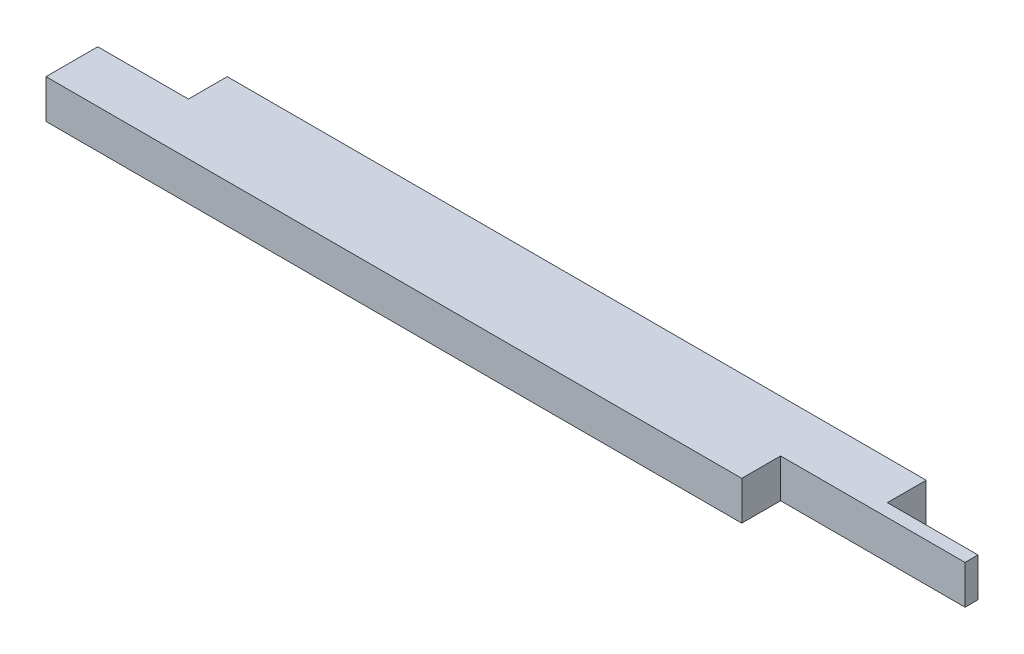
ISO-10303-21;
HEADER;
FILE_DESCRIPTION(('STEP AP214'),'2;1');
FILE_NAME('part.step','',(''),(''),'','','');
FILE_SCHEMA(('AUTOMOTIVE_DESIGN { 1 0 10303 214 1 1 1 1 }'));
ENDSEC;
DATA;
#1=APPLICATION_CONTEXT('core data for automotive mechanical design processes');
#2=APPLICATION_PROTOCOL_DEFINITION('international standard','automotive_design',2000,#1);
#3=PRODUCT_CONTEXT('',#1,'mechanical');
#4=PRODUCT('Part','Part','',(#3));
#5=PRODUCT_RELATED_PRODUCT_CATEGORY('part','',(#4));
#6=PRODUCT_DEFINITION_FORMATION('','',#4);
#7=PRODUCT_DEFINITION_CONTEXT('part definition',#1,'design');
#8=PRODUCT_DEFINITION('design','',#6,#7);
#9=PRODUCT_DEFINITION_SHAPE('','',#8);
#10=(LENGTH_UNIT() NAMED_UNIT(*) SI_UNIT(.MILLI.,.METRE.));
#11=(NAMED_UNIT(*) PLANE_ANGLE_UNIT() SI_UNIT($,.RADIAN.));
#12=(NAMED_UNIT(*) SI_UNIT($,.STERADIAN.) SOLID_ANGLE_UNIT());
#13=UNCERTAINTY_MEASURE_WITH_UNIT(LENGTH_MEASURE(1.E-05),#10,'distance_accuracy_value','');
#14=(GEOMETRIC_REPRESENTATION_CONTEXT(3) GLOBAL_UNCERTAINTY_ASSIGNED_CONTEXT((#13)) GLOBAL_UNIT_ASSIGNED_CONTEXT((#10,
#11,#12)) REPRESENTATION_CONTEXT('',''));
#15=CARTESIAN_POINT('',(0.,0.,0.));
#16=DIRECTION('',(0.,0.,1.));
#17=DIRECTION('',(1.,0.,0.));
#18=AXIS2_PLACEMENT_3D('',#15,#16,#17);
#19=CARTESIAN_POINT('',(0.,38.1,0.));
#20=DIRECTION('',(1.,0.,0.));
#21=DIRECTION('',(0.,0.,-1.));
#22=AXIS2_PLACEMENT_3D('',#19,#20,#21);
#23=PLANE('',#22);
#24=DIRECTION('',(0.,0.,1.));
#25=VECTOR('',#24,1.);
#26=CARTESIAN_POINT('',(0.,38.1,0.));
#27=LINE('',#26,#25);
#28=CARTESIAN_POINT('',(0.,38.1,-50.8));
#29=VERTEX_POINT('',#28);
#30=CARTESIAN_POINT('',(0.,38.1,0.));
#31=VERTEX_POINT('',#30);
#32=EDGE_CURVE('E150',#29,#31,#27,.T.);
#33=ORIENTED_EDGE('',*,*,#32,.F.);
#34=DIRECTION('',(0.,1.,0.));
#35=VECTOR('',#34,1.);
#36=CARTESIAN_POINT('',(0.,0.,-50.8));
#37=LINE('',#36,#35);
#38=CARTESIAN_POINT('',(0.,0.,-50.8));
#39=VERTEX_POINT('',#38);
#40=EDGE_CURVE('E193',#39,#29,#37,.T.);
#41=ORIENTED_EDGE('',*,*,#40,.F.);
#42=DIRECTION('',(0.,0.,1.));
#43=VECTOR('',#42,1.);
#44=CARTESIAN_POINT('',(0.,0.,0.));
#45=LINE('',#44,#43);
#46=CARTESIAN_POINT('',(0.,0.,0.));
#47=VERTEX_POINT('',#46);
#48=EDGE_CURVE('E152',#39,#47,#45,.T.);
#49=ORIENTED_EDGE('',*,*,#48,.T.);
#50=DIRECTION('',(0.,-1.,0.));
#51=VECTOR('',#50,1.);
#52=CARTESIAN_POINT('',(0.,38.1,0.));
#53=LINE('',#52,#51);
#54=EDGE_CURVE('E11',#31,#47,#53,.T.);
#55=ORIENTED_EDGE('',*,*,#54,.F.);
#56=EDGE_LOOP('',(#33,#41,#49,#55));
#57=FACE_BOUND('',#56,.T.);
#58=ADVANCED_FACE('F41',(#57),#23,.F.);
#59=CARTESIAN_POINT('',(0.,38.1,0.));
#60=DIRECTION('',(0.,0.,-1.));
#61=DIRECTION('',(-1.,0.,0.));
#62=AXIS2_PLACEMENT_3D('',#59,#60,#61);
#63=PLANE('',#62);
#64=DIRECTION('',(1.,0.,0.));
#65=VECTOR('',#64,1.);
#66=CARTESIAN_POINT('',(0.,0.,0.));
#67=LINE('',#66,#65);
#68=CARTESIAN_POINT('',(682.625,0.,0.));
#69=VERTEX_POINT('',#68);
#70=EDGE_CURVE('E144',#47,#69,#67,.T.);
#71=ORIENTED_EDGE('',*,*,#70,.T.);
#72=DIRECTION('',(0.,1.,0.));
#73=VECTOR('',#72,1.);
#74=CARTESIAN_POINT('',(682.625,0.,0.));
#75=LINE('',#74,#73);
#76=CARTESIAN_POINT('',(682.625,38.1,0.));
#77=VERTEX_POINT('',#76);
#78=EDGE_CURVE('E188',#69,#77,#75,.T.);
#79=ORIENTED_EDGE('',*,*,#78,.T.);
#80=DIRECTION('',(1.,0.,0.));
#81=VECTOR('',#80,1.);
#82=CARTESIAN_POINT('',(0.,38.1,0.));
#83=LINE('',#82,#81);
#84=EDGE_CURVE('E163',#31,#77,#83,.T.);
#85=ORIENTED_EDGE('',*,*,#84,.F.);
#86=ORIENTED_EDGE('',*,*,#54,.T.);
#87=EDGE_LOOP('',(#71,#79,#85,#86));
#88=FACE_BOUND('',#87,.T.);
#89=ADVANCED_FACE('F229',(#88),#63,.F.);
#90=CARTESIAN_POINT('',(863.6,38.1,0.));
#91=DIRECTION('',(-1.,0.,0.));
#92=DIRECTION('',(0.,0.,1.));
#93=AXIS2_PLACEMENT_3D('',#90,#91,#92);
#94=PLANE('',#93);
#95=DIRECTION('',(0.,0.,-1.));
#96=VECTOR('',#95,1.);
#97=CARTESIAN_POINT('',(863.6,38.1,0.));
#98=LINE('',#97,#96);
#99=CARTESIAN_POINT('',(863.6,38.1,-38.1));
#100=VERTEX_POINT('',#99);
#101=CARTESIAN_POINT('',(863.6,38.1,-50.8));
#102=VERTEX_POINT('',#101);
#103=EDGE_CURVE('E135',#100,#102,#98,.T.);
#104=ORIENTED_EDGE('',*,*,#103,.F.);
#105=DIRECTION('',(0.,1.,0.));
#106=VECTOR('',#105,1.);
#107=CARTESIAN_POINT('',(863.6,0.,-38.1));
#108=LINE('',#107,#106);
#109=CARTESIAN_POINT('',(863.6,0.,-38.1));
#110=VERTEX_POINT('',#109);
#111=EDGE_CURVE('E121',#110,#100,#108,.T.);
#112=ORIENTED_EDGE('',*,*,#111,.F.);
#113=DIRECTION('',(0.,0.,-1.));
#114=VECTOR('',#113,1.);
#115=CARTESIAN_POINT('',(863.6,0.,0.));
#116=LINE('',#115,#114);
#117=CARTESIAN_POINT('',(863.6,0.,-50.8));
#118=VERTEX_POINT('',#117);
#119=EDGE_CURVE('E133',#110,#118,#116,.T.);
#120=ORIENTED_EDGE('',*,*,#119,.T.);
#121=DIRECTION('',(0.,1.,0.));
#122=VECTOR('',#121,1.);
#123=CARTESIAN_POINT('',(863.6,0.,-50.8));
#124=LINE('',#123,#122);
#125=EDGE_CURVE('E184',#118,#102,#124,.T.);
#126=ORIENTED_EDGE('',*,*,#125,.T.);
#127=EDGE_LOOP('',(#104,#112,#120,#126));
#128=FACE_BOUND('',#127,.T.);
#129=ADVANCED_FACE('F131',(#128),#94,.F.);
#130=CARTESIAN_POINT('',(0.,38.1,-88.9));
#131=DIRECTION('',(0.,0.,1.));
#132=DIRECTION('',(1.,0.,0.));
#133=AXIS2_PLACEMENT_3D('',#130,#131,#132);
#134=PLANE('',#133);
#135=DIRECTION('',(-1.,0.,0.));
#136=VECTOR('',#135,1.);
#137=CARTESIAN_POINT('',(0.,0.,-88.9));
#138=LINE('',#137,#136);
#139=CARTESIAN_POINT('',(774.7,0.,-88.9));
#140=VERTEX_POINT('',#139);
#141=CARTESIAN_POINT('',(88.9,0.,-88.9));
#142=VERTEX_POINT('',#141);
#143=EDGE_CURVE('E143',#140,#142,#138,.T.);
#144=ORIENTED_EDGE('',*,*,#143,.T.);
#145=DIRECTION('',(0.,1.,0.));
#146=VECTOR('',#145,1.);
#147=CARTESIAN_POINT('',(88.9,0.,-88.9));
#148=LINE('',#147,#146);
#149=CARTESIAN_POINT('',(88.9,38.1,-88.9));
#150=VERTEX_POINT('',#149);
#151=EDGE_CURVE('E157',#142,#150,#148,.T.);
#152=ORIENTED_EDGE('',*,*,#151,.T.);
#153=DIRECTION('',(-1.,0.,0.));
#154=VECTOR('',#153,1.);
#155=CARTESIAN_POINT('',(0.,38.1,-88.9));
#156=LINE('',#155,#154);
#157=CARTESIAN_POINT('',(774.7,38.1,-88.9));
#158=VERTEX_POINT('',#157);
#159=EDGE_CURVE('E49',#158,#150,#156,.T.);
#160=ORIENTED_EDGE('',*,*,#159,.F.);
#161=DIRECTION('',(0.,1.,0.));
#162=VECTOR('',#161,1.);
#163=CARTESIAN_POINT('',(774.7,0.,-88.9));
#164=LINE('',#163,#162);
#165=EDGE_CURVE('E175',#140,#158,#164,.T.);
#166=ORIENTED_EDGE('',*,*,#165,.F.);
#167=EDGE_LOOP('',(#144,#152,#160,#166));
#168=FACE_BOUND('',#167,.T.);
#169=ADVANCED_FACE('F244',(#168),#134,.F.);
#170=CARTESIAN_POINT('',(0.,38.1,0.));
#171=DIRECTION('',(0.,-1.,0.));
#172=DIRECTION('',(0.,0.,-1.));
#173=AXIS2_PLACEMENT_3D('',#170,#171,#172);
#174=PLANE('',#173);
#175=ORIENTED_EDGE('',*,*,#84,.T.);
#176=DIRECTION('',(0.,0.,1.));
#177=VECTOR('',#176,1.);
#178=CARTESIAN_POINT('',(682.625,38.1,0.));
#179=LINE('',#178,#177);
#180=CARTESIAN_POINT('',(682.625,38.1,-38.1));
#181=VERTEX_POINT('',#180);
#182=EDGE_CURVE('E127',#181,#77,#179,.T.);
#183=ORIENTED_EDGE('',*,*,#182,.F.);
#184=DIRECTION('',(-1.,0.,0.));
#185=VECTOR('',#184,1.);
#186=CARTESIAN_POINT('',(863.6,38.1,-38.1));
#187=LINE('',#186,#185);
#188=EDGE_CURVE('E221',#100,#181,#187,.T.);
#189=ORIENTED_EDGE('',*,*,#188,.F.);
#190=ORIENTED_EDGE('',*,*,#103,.T.);
#191=DIRECTION('',(1.,0.,0.));
#192=VECTOR('',#191,1.);
#193=CARTESIAN_POINT('',(863.6,38.1,-50.8));
#194=LINE('',#193,#192);
#195=CARTESIAN_POINT('',(774.7,38.1,-50.8));
#196=VERTEX_POINT('',#195);
#197=EDGE_CURVE('E172',#196,#102,#194,.T.);
#198=ORIENTED_EDGE('',*,*,#197,.F.);
#199=DIRECTION('',(0.,0.,1.));
#200=VECTOR('',#199,1.);
#201=CARTESIAN_POINT('',(774.7,38.1,-88.9));
#202=LINE('',#201,#200);
#203=EDGE_CURVE('E176',#158,#196,#202,.T.);
#204=ORIENTED_EDGE('',*,*,#203,.F.);
#205=ORIENTED_EDGE('',*,*,#159,.T.);
#206=DIRECTION('',(0.,0.,-1.));
#207=VECTOR('',#206,1.);
#208=CARTESIAN_POINT('',(88.9,38.1,-88.9));
#209=LINE('',#208,#207);
#210=CARTESIAN_POINT('',(88.9,38.1,-50.8));
#211=VERTEX_POINT('',#210);
#212=EDGE_CURVE('E202',#211,#150,#209,.T.);
#213=ORIENTED_EDGE('',*,*,#212,.F.);
#214=DIRECTION('',(1.,0.,0.));
#215=VECTOR('',#214,1.);
#216=CARTESIAN_POINT('',(0.,38.1,-50.8));
#217=LINE('',#216,#215);
#218=EDGE_CURVE('E180',#29,#211,#217,.T.);
#219=ORIENTED_EDGE('',*,*,#218,.F.);
#220=ORIENTED_EDGE('',*,*,#32,.T.);
#221=EDGE_LOOP('',(#175,#183,#189,#190,#198,#204,#205,#213,#219,#220));
#222=FACE_BOUND('',#221,.T.);
#223=ADVANCED_FACE('F247',(#222),#174,.F.);
#224=CARTESIAN_POINT('',(0.,0.,0.));
#225=DIRECTION('',(0.,-1.,0.));
#226=DIRECTION('',(0.,0.,-1.));
#227=AXIS2_PLACEMENT_3D('',#224,#225,#226);
#228=PLANE('',#227);
#229=DIRECTION('',(0.,0.,1.));
#230=VECTOR('',#229,1.);
#231=CARTESIAN_POINT('',(682.625,0.,0.));
#232=LINE('',#231,#230);
#233=CARTESIAN_POINT('',(682.625,0.,-38.1));
#234=VERTEX_POINT('',#233);
#235=EDGE_CURVE('E56',#234,#69,#232,.T.);
#236=ORIENTED_EDGE('',*,*,#235,.T.);
#237=ORIENTED_EDGE('',*,*,#70,.F.);
#238=ORIENTED_EDGE('',*,*,#48,.F.);
#239=DIRECTION('',(1.,0.,0.));
#240=VECTOR('',#239,1.);
#241=CARTESIAN_POINT('',(0.,0.,-50.8));
#242=LINE('',#241,#240);
#243=CARTESIAN_POINT('',(88.9,0.,-50.8));
#244=VERTEX_POINT('',#243);
#245=EDGE_CURVE('E205',#39,#244,#242,.T.);
#246=ORIENTED_EDGE('',*,*,#245,.T.);
#247=DIRECTION('',(0.,0.,-1.));
#248=VECTOR('',#247,1.);
#249=CARTESIAN_POINT('',(88.9,0.,-88.9));
#250=LINE('',#249,#248);
#251=EDGE_CURVE('E64',#244,#142,#250,.T.);
#252=ORIENTED_EDGE('',*,*,#251,.T.);
#253=ORIENTED_EDGE('',*,*,#143,.F.);
#254=DIRECTION('',(0.,0.,1.));
#255=VECTOR('',#254,1.);
#256=CARTESIAN_POINT('',(774.7,0.,-88.9));
#257=LINE('',#256,#255);
#258=CARTESIAN_POINT('',(774.7,0.,-50.8));
#259=VERTEX_POINT('',#258);
#260=EDGE_CURVE('E169',#140,#259,#257,.T.);
#261=ORIENTED_EDGE('',*,*,#260,.T.);
#262=DIRECTION('',(1.,0.,0.));
#263=VECTOR('',#262,1.);
#264=CARTESIAN_POINT('',(863.6,0.,-50.8));
#265=LINE('',#264,#263);
#266=EDGE_CURVE('E141',#259,#118,#265,.T.);
#267=ORIENTED_EDGE('',*,*,#266,.T.);
#268=ORIENTED_EDGE('',*,*,#119,.F.);
#269=DIRECTION('',(-1.,0.,0.));
#270=VECTOR('',#269,1.);
#271=CARTESIAN_POINT('',(863.6,0.,-38.1));
#272=LINE('',#271,#270);
#273=EDGE_CURVE('E117',#110,#234,#272,.T.);
#274=ORIENTED_EDGE('',*,*,#273,.T.);
#275=EDGE_LOOP('',(#236,#237,#238,#246,#252,#253,#261,#267,#268,#274));
#276=FACE_BOUND('',#275,.T.);
#277=ADVANCED_FACE('F139',(#276),#228,.T.);
#278=CARTESIAN_POINT('',(863.6,0.,-50.8));
#279=DIRECTION('',(0.,0.,1.));
#280=DIRECTION('',(1.,0.,0.));
#281=AXIS2_PLACEMENT_3D('',#278,#279,#280);
#282=PLANE('',#281);
#283=ORIENTED_EDGE('',*,*,#197,.T.);
#284=ORIENTED_EDGE('',*,*,#125,.F.);
#285=ORIENTED_EDGE('',*,*,#266,.F.);
#286=DIRECTION('',(0.,1.,0.));
#287=VECTOR('',#286,1.);
#288=CARTESIAN_POINT('',(774.7,0.,-50.8));
#289=LINE('',#288,#287);
#290=EDGE_CURVE('E187',#259,#196,#289,.T.);
#291=ORIENTED_EDGE('',*,*,#290,.T.);
#292=EDGE_LOOP('',(#283,#284,#285,#291));
#293=FACE_BOUND('',#292,.T.);
#294=ADVANCED_FACE('F253',(#293),#282,.F.);
#295=CARTESIAN_POINT('',(774.7,0.,-88.9));
#296=DIRECTION('',(-1.,0.,0.));
#297=DIRECTION('',(0.,0.,1.));
#298=AXIS2_PLACEMENT_3D('',#295,#296,#297);
#299=PLANE('',#298);
#300=ORIENTED_EDGE('',*,*,#203,.T.);
#301=ORIENTED_EDGE('',*,*,#290,.F.);
#302=ORIENTED_EDGE('',*,*,#260,.F.);
#303=ORIENTED_EDGE('',*,*,#165,.T.);
#304=EDGE_LOOP('',(#300,#301,#302,#303));
#305=FACE_BOUND('',#304,.T.);
#306=ADVANCED_FACE('F251',(#305),#299,.F.);
#307=CARTESIAN_POINT('',(88.9,0.,-88.9));
#308=DIRECTION('',(1.,0.,0.));
#309=DIRECTION('',(0.,0.,-1.));
#310=AXIS2_PLACEMENT_3D('',#307,#308,#309);
#311=PLANE('',#310);
#312=ORIENTED_EDGE('',*,*,#212,.T.);
#313=ORIENTED_EDGE('',*,*,#151,.F.);
#314=ORIENTED_EDGE('',*,*,#251,.F.);
#315=DIRECTION('',(0.,1.,0.));
#316=VECTOR('',#315,1.);
#317=CARTESIAN_POINT('',(88.9,0.,-50.8));
#318=LINE('',#317,#316);
#319=EDGE_CURVE('E196',#244,#211,#318,.T.);
#320=ORIENTED_EDGE('',*,*,#319,.T.);
#321=EDGE_LOOP('',(#312,#313,#314,#320));
#322=FACE_BOUND('',#321,.T.);
#323=ADVANCED_FACE('F240',(#322),#311,.F.);
#324=CARTESIAN_POINT('',(0.,0.,-50.8));
#325=DIRECTION('',(0.,0.,1.));
#326=DIRECTION('',(1.,0.,0.));
#327=AXIS2_PLACEMENT_3D('',#324,#325,#326);
#328=PLANE('',#327);
#329=ORIENTED_EDGE('',*,*,#218,.T.);
#330=ORIENTED_EDGE('',*,*,#319,.F.);
#331=ORIENTED_EDGE('',*,*,#245,.F.);
#332=ORIENTED_EDGE('',*,*,#40,.T.);
#333=EDGE_LOOP('',(#329,#330,#331,#332));
#334=FACE_BOUND('',#333,.T.);
#335=ADVANCED_FACE('F237',(#334),#328,.F.);
#336=CARTESIAN_POINT('',(682.625,0.,0.));
#337=DIRECTION('',(-1.,0.,0.));
#338=DIRECTION('',(0.,0.,1.));
#339=AXIS2_PLACEMENT_3D('',#336,#337,#338);
#340=PLANE('',#339);
#341=ORIENTED_EDGE('',*,*,#182,.T.);
#342=ORIENTED_EDGE('',*,*,#78,.F.);
#343=ORIENTED_EDGE('',*,*,#235,.F.);
#344=DIRECTION('',(0.,1.,0.));
#345=VECTOR('',#344,1.);
#346=CARTESIAN_POINT('',(682.625,0.,-38.1));
#347=LINE('',#346,#345);
#348=EDGE_CURVE('E123',#234,#181,#347,.T.);
#349=ORIENTED_EDGE('',*,*,#348,.T.);
#350=EDGE_LOOP('',(#341,#342,#343,#349));
#351=FACE_BOUND('',#350,.T.);
#352=ADVANCED_FACE('F289',(#351),#340,.F.);
#353=CARTESIAN_POINT('',(863.6,0.,-38.1));
#354=DIRECTION('',(0.,0.,-1.));
#355=DIRECTION('',(-1.,0.,0.));
#356=AXIS2_PLACEMENT_3D('',#353,#354,#355);
#357=PLANE('',#356);
#358=ORIENTED_EDGE('',*,*,#188,.T.);
#359=ORIENTED_EDGE('',*,*,#348,.F.);
#360=ORIENTED_EDGE('',*,*,#273,.F.);
#361=ORIENTED_EDGE('',*,*,#111,.T.);
#362=EDGE_LOOP('',(#358,#359,#360,#361));
#363=FACE_BOUND('',#362,.T.);
#364=ADVANCED_FACE('F120',(#363),#357,.F.);
#365=CLOSED_SHELL('',(#58,#89,#129,#169,#223,#277,#294,#306,#323,#335,#352,#364));
#366=MANIFOLD_SOLID_BREP('B2',#365);
#367=ADVANCED_BREP_SHAPE_REPRESENTATION('',(#18,#366),#14);
#368=SHAPE_DEFINITION_REPRESENTATION(#9,#367);
ENDSEC;
END-ISO-10303-21;
